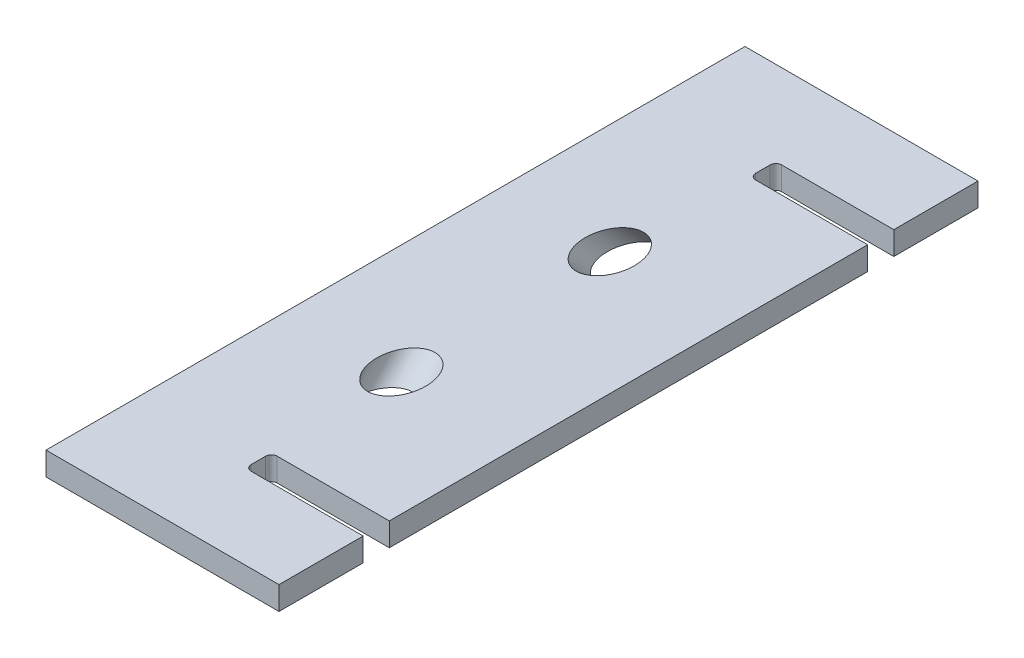
ISO-10303-21;
HEADER;
FILE_DESCRIPTION(('STEP AP214'),'2;1');
FILE_NAME('part.step','',(''),(''),'','','');
FILE_SCHEMA(('AUTOMOTIVE_DESIGN { 1 0 10303 214 1 1 1 1 }'));
ENDSEC;
DATA;
#1=APPLICATION_CONTEXT('core data for automotive mechanical design processes');
#2=APPLICATION_PROTOCOL_DEFINITION('international standard','automotive_design',2000,#1);
#3=PRODUCT_CONTEXT('',#1,'mechanical');
#4=PRODUCT('Part','Part','',(#3));
#5=PRODUCT_RELATED_PRODUCT_CATEGORY('part','',(#4));
#6=PRODUCT_DEFINITION_FORMATION('','',#4);
#7=PRODUCT_DEFINITION_CONTEXT('part definition',#1,'design');
#8=PRODUCT_DEFINITION('design','',#6,#7);
#9=PRODUCT_DEFINITION_SHAPE('','',#8);
#10=(LENGTH_UNIT() NAMED_UNIT(*) SI_UNIT(.MILLI.,.METRE.));
#11=(NAMED_UNIT(*) PLANE_ANGLE_UNIT() SI_UNIT($,.RADIAN.));
#12=(NAMED_UNIT(*) SI_UNIT($,.STERADIAN.) SOLID_ANGLE_UNIT());
#13=UNCERTAINTY_MEASURE_WITH_UNIT(LENGTH_MEASURE(1.E-05),#10,'distance_accuracy_value','');
#14=(GEOMETRIC_REPRESENTATION_CONTEXT(3) GLOBAL_UNCERTAINTY_ASSIGNED_CONTEXT((#13)) GLOBAL_UNIT_ASSIGNED_CONTEXT((#10,
#11,#12)) REPRESENTATION_CONTEXT('',''));
#15=CARTESIAN_POINT('',(0.,0.,0.));
#16=DIRECTION('',(0.,0.,1.));
#17=DIRECTION('',(1.,0.,0.));
#18=AXIS2_PLACEMENT_3D('',#15,#16,#17);
#19=CARTESIAN_POINT('',(2540.,217.4,-190.5));
#20=DIRECTION('',(-1.,0.,0.));
#21=DIRECTION('',(0.,0.,1.));
#22=AXIS2_PLACEMENT_3D('',#19,#20,#21);
#23=PLANE('',#22);
#24=DIRECTION('',(0.,0.,1.));
#25=VECTOR('',#24,1.);
#26=CARTESIAN_POINT('',(2540.,230.1,-190.5));
#27=LINE('',#26,#25);
#28=CARTESIAN_POINT('',(2540.,230.1,-190.5));
#29=VERTEX_POINT('',#28);
#30=CARTESIAN_POINT('',(2540.,230.1,190.5));
#31=VERTEX_POINT('',#30);
#32=EDGE_CURVE('E206',#29,#31,#27,.T.);
#33=ORIENTED_EDGE('',*,*,#32,.F.);
#34=DIRECTION('',(0.,1.,0.));
#35=VECTOR('',#34,1.);
#36=CARTESIAN_POINT('',(2540.,217.4,-190.5));
#37=LINE('',#36,#35);
#38=CARTESIAN_POINT('',(2540.,217.4,-190.5));
#39=VERTEX_POINT('',#38);
#40=EDGE_CURVE('E186',#39,#29,#37,.T.);
#41=ORIENTED_EDGE('',*,*,#40,.F.);
#42=DIRECTION('',(0.,0.,1.));
#43=VECTOR('',#42,1.);
#44=CARTESIAN_POINT('',(2540.,217.4,-190.5));
#45=LINE('',#44,#43);
#46=CARTESIAN_POINT('',(2540.,217.4,190.5));
#47=VERTEX_POINT('',#46);
#48=EDGE_CURVE('E171',#39,#47,#45,.T.);
#49=ORIENTED_EDGE('',*,*,#48,.T.);
#50=DIRECTION('',(0.,1.,0.));
#51=VECTOR('',#50,1.);
#52=CARTESIAN_POINT('',(2540.,217.4,190.5));
#53=LINE('',#52,#51);
#54=EDGE_CURVE('E159',#47,#31,#53,.T.);
#55=ORIENTED_EDGE('',*,*,#54,.T.);
#56=EDGE_LOOP('',(#33,#41,#49,#55));
#57=FACE_BOUND('',#56,.T.);
#58=ADVANCED_FACE('F47',(#57),#23,.T.);
#59=CARTESIAN_POINT('',(2540.,217.4,-190.5));
#60=DIRECTION('',(0.,0.,-1.));
#61=DIRECTION('',(-1.,0.,0.));
#62=AXIS2_PLACEMENT_3D('',#59,#60,#61);
#63=PLANE('',#62);
#64=DIRECTION('',(-1.,0.,0.));
#65=VECTOR('',#64,1.);
#66=CARTESIAN_POINT('',(2540.,230.1,-190.5));
#67=LINE('',#66,#65);
#68=CARTESIAN_POINT('',(2667.,230.1,-190.5));
#69=VERTEX_POINT('',#68);
#70=EDGE_CURVE('E227',#69,#29,#67,.T.);
#71=ORIENTED_EDGE('',*,*,#70,.F.);
#72=DIRECTION('',(0.,1.,0.));
#73=VECTOR('',#72,1.);
#74=CARTESIAN_POINT('',(2667.,217.4,-190.5));
#75=LINE('',#74,#73);
#76=CARTESIAN_POINT('',(2667.,217.4,-190.5));
#77=VERTEX_POINT('',#76);
#78=EDGE_CURVE('E203',#77,#69,#75,.T.);
#79=ORIENTED_EDGE('',*,*,#78,.F.);
#80=DIRECTION('',(-1.,0.,0.));
#81=VECTOR('',#80,1.);
#82=CARTESIAN_POINT('',(2540.,217.4,-190.5));
#83=LINE('',#82,#81);
#84=EDGE_CURVE('E170',#77,#39,#83,.T.);
#85=ORIENTED_EDGE('',*,*,#84,.T.);
#86=ORIENTED_EDGE('',*,*,#40,.T.);
#87=EDGE_LOOP('',(#71,#79,#85,#86));
#88=FACE_BOUND('',#87,.T.);
#89=ADVANCED_FACE('F398',(#88),#63,.T.);
#90=CARTESIAN_POINT('',(2667.,217.4,-190.5));
#91=DIRECTION('',(1.,0.,0.));
#92=DIRECTION('',(0.,0.,-1.));
#93=AXIS2_PLACEMENT_3D('',#90,#91,#92);
#94=PLANE('',#93);
#95=DIRECTION('',(0.,0.,-1.));
#96=VECTOR('',#95,1.);
#97=CARTESIAN_POINT('',(2667.,230.1,-190.5));
#98=LINE('',#97,#96);
#99=CARTESIAN_POINT('',(2667.,230.1,-144.604086105115));
#100=VERTEX_POINT('',#99);
#101=EDGE_CURVE('E223',#100,#69,#98,.T.);
#102=ORIENTED_EDGE('',*,*,#101,.F.);
#103=DIRECTION('',(0.,1.,0.));
#104=VECTOR('',#103,1.);
#105=CARTESIAN_POINT('',(2667.,217.4,-144.604086105115));
#106=LINE('',#105,#104);
#107=CARTESIAN_POINT('',(2667.,217.4,-144.604086105115));
#108=VERTEX_POINT('',#107);
#109=EDGE_CURVE('E264',#108,#100,#106,.T.);
#110=ORIENTED_EDGE('',*,*,#109,.F.);
#111=DIRECTION('',(0.,0.,-1.));
#112=VECTOR('',#111,1.);
#113=CARTESIAN_POINT('',(2667.,217.4,-190.5));
#114=LINE('',#113,#112);
#115=EDGE_CURVE('E199',#108,#77,#114,.T.);
#116=ORIENTED_EDGE('',*,*,#115,.T.);
#117=ORIENTED_EDGE('',*,*,#78,.T.);
#118=EDGE_LOOP('',(#102,#110,#116,#117));
#119=FACE_BOUND('',#118,.T.);
#120=ADVANCED_FACE('F395',(#119),#94,.T.);
#121=CARTESIAN_POINT('',(2603.5,217.4,-144.604086105115));
#122=DIRECTION('',(0.,0.,1.));
#123=DIRECTION('',(1.,0.,0.));
#124=AXIS2_PLACEMENT_3D('',#121,#122,#123);
#125=PLANE('',#124);
#126=DIRECTION('',(1.,0.,0.));
#127=VECTOR('',#126,1.);
#128=CARTESIAN_POINT('',(0.,230.1,-144.604086105115));
#129=LINE('',#128,#127);
#130=CARTESIAN_POINT('',(2605.913,230.1,-144.604086105115));
#131=VERTEX_POINT('',#130);
#132=EDGE_CURVE('E228',#131,#100,#129,.T.);
#133=ORIENTED_EDGE('',*,*,#132,.F.);
#134=DIRECTION('',(0.,1.,0.));
#135=VECTOR('',#134,1.);
#136=CARTESIAN_POINT('',(2605.913,217.4,-144.604086105115));
#137=LINE('',#136,#135);
#138=CARTESIAN_POINT('',(2605.913,217.4,-144.604086105115));
#139=VERTEX_POINT('',#138);
#140=EDGE_CURVE('E309',#131,#139,#137,.F.);
#141=ORIENTED_EDGE('',*,*,#140,.T.);
#142=DIRECTION('',(1.,0.,0.));
#143=VECTOR('',#142,1.);
#144=CARTESIAN_POINT('',(0.,217.4,-144.604086105115));
#145=LINE('',#144,#143);
#146=EDGE_CURVE('E237',#139,#108,#145,.T.);
#147=ORIENTED_EDGE('',*,*,#146,.T.);
#148=ORIENTED_EDGE('',*,*,#109,.T.);
#149=EDGE_LOOP('',(#133,#141,#147,#148));
#150=FACE_BOUND('',#149,.T.);
#151=ADVANCED_FACE('F391',(#150),#125,.T.);
#152=CARTESIAN_POINT('',(2602.738,217.4,-131.142086105115));
#153=DIRECTION('',(1.,0.,0.));
#154=DIRECTION('',(0.,0.,-1.));
#155=AXIS2_PLACEMENT_3D('',#152,#153,#154);
#156=PLANE('',#155);
#157=DIRECTION('',(0.,0.,-1.));
#158=VECTOR('',#157,1.);
#159=CARTESIAN_POINT('',(2602.738,217.4,9.10116426666717E-11));
#160=LINE('',#159,#158);
#161=CARTESIAN_POINT('',(2602.738,217.4,-133.555086105115));
#162=VERTEX_POINT('',#161);
#163=CARTESIAN_POINT('',(2602.738,217.4,-141.429086105115));
#164=VERTEX_POINT('',#163);
#165=EDGE_CURVE('E268',#162,#164,#160,.T.);
#166=ORIENTED_EDGE('',*,*,#165,.T.);
#167=DIRECTION('',(0.,1.,0.));
#168=VECTOR('',#167,1.);
#169=CARTESIAN_POINT('',(2602.738,230.1,-141.429086105115));
#170=LINE('',#169,#168);
#171=CARTESIAN_POINT('',(2602.738,230.1,-141.429086105115));
#172=VERTEX_POINT('',#171);
#173=EDGE_CURVE('E305',#164,#172,#170,.T.);
#174=ORIENTED_EDGE('',*,*,#173,.T.);
#175=DIRECTION('',(0.,0.,-1.));
#176=VECTOR('',#175,1.);
#177=CARTESIAN_POINT('',(2602.738,230.1,9.10116426666717E-11));
#178=LINE('',#177,#176);
#179=CARTESIAN_POINT('',(2602.738,230.1,-133.555086105115));
#180=VERTEX_POINT('',#179);
#181=EDGE_CURVE('E258',#180,#172,#178,.T.);
#182=ORIENTED_EDGE('',*,*,#181,.F.);
#183=DIRECTION('',(0.,1.,0.));
#184=VECTOR('',#183,1.);
#185=CARTESIAN_POINT('',(2602.738,217.4,-133.555086105115));
#186=LINE('',#185,#184);
#187=EDGE_CURVE('E248',#180,#162,#186,.F.);
#188=ORIENTED_EDGE('',*,*,#187,.T.);
#189=EDGE_LOOP('',(#166,#174,#182,#188));
#190=FACE_BOUND('',#189,.T.);
#191=ADVANCED_FACE('F381',(#190),#156,.T.);
#192=CARTESIAN_POINT('',(2667.,217.4,-130.380086105115));
#193=DIRECTION('',(0.,0.,-1.));
#194=DIRECTION('',(-1.,0.,0.));
#195=AXIS2_PLACEMENT_3D('',#192,#193,#194);
#196=PLANE('',#195);
#197=DIRECTION('',(-1.,0.,0.));
#198=VECTOR('',#197,1.);
#199=CARTESIAN_POINT('',(0.,217.4,-130.380086105115));
#200=LINE('',#199,#198);
#201=CARTESIAN_POINT('',(2667.,217.4,-130.380086105115));
#202=VERTEX_POINT('',#201);
#203=CARTESIAN_POINT('',(2605.913,217.4,-130.380086105115));
#204=VERTEX_POINT('',#203);
#205=EDGE_CURVE('E198',#202,#204,#200,.T.);
#206=ORIENTED_EDGE('',*,*,#205,.T.);
#207=DIRECTION('',(0.,1.,0.));
#208=VECTOR('',#207,1.);
#209=CARTESIAN_POINT('',(2605.913,230.1,-130.380086105115));
#210=LINE('',#209,#208);
#211=CARTESIAN_POINT('',(2605.913,230.1,-130.380086105115));
#212=VERTEX_POINT('',#211);
#213=EDGE_CURVE('E312',#204,#212,#210,.T.);
#214=ORIENTED_EDGE('',*,*,#213,.T.);
#215=DIRECTION('',(-1.,0.,0.));
#216=VECTOR('',#215,1.);
#217=CARTESIAN_POINT('',(0.,230.1,-130.380086105115));
#218=LINE('',#217,#216);
#219=CARTESIAN_POINT('',(2667.,230.1,-130.380086105115));
#220=VERTEX_POINT('',#219);
#221=EDGE_CURVE('E221',#220,#212,#218,.T.);
#222=ORIENTED_EDGE('',*,*,#221,.F.);
#223=DIRECTION('',(0.,1.,0.));
#224=VECTOR('',#223,1.);
#225=CARTESIAN_POINT('',(2667.,217.4,-130.380086105115));
#226=LINE('',#225,#224);
#227=EDGE_CURVE('E197',#202,#220,#226,.T.);
#228=ORIENTED_EDGE('',*,*,#227,.F.);
#229=EDGE_LOOP('',(#206,#214,#222,#228));
#230=FACE_BOUND('',#229,.T.);
#231=ADVANCED_FACE('F373',(#230),#196,.T.);
#232=CARTESIAN_POINT('',(2667.,217.4,-131.142086105115));
#233=DIRECTION('',(1.,0.,0.));
#234=DIRECTION('',(0.,0.,-1.));
#235=AXIS2_PLACEMENT_3D('',#232,#233,#234);
#236=PLANE('',#235);
#237=DIRECTION('',(0.,0.,-1.));
#238=VECTOR('',#237,1.);
#239=CARTESIAN_POINT('',(2667.,230.1,-131.142086105115));
#240=LINE('',#239,#238);
#241=CARTESIAN_POINT('',(2667.,230.1,130.380086105115));
#242=VERTEX_POINT('',#241);
#243=EDGE_CURVE('E217',#242,#220,#240,.T.);
#244=ORIENTED_EDGE('',*,*,#243,.F.);
#245=DIRECTION('',(0.,1.,0.));
#246=VECTOR('',#245,1.);
#247=CARTESIAN_POINT('',(2667.,217.4,130.380086105115));
#248=LINE('',#247,#246);
#249=CARTESIAN_POINT('',(2667.,217.4,130.380086105115));
#250=VERTEX_POINT('',#249);
#251=EDGE_CURVE('E283',#250,#242,#248,.T.);
#252=ORIENTED_EDGE('',*,*,#251,.F.);
#253=DIRECTION('',(0.,0.,-1.));
#254=VECTOR('',#253,1.);
#255=CARTESIAN_POINT('',(2667.,217.4,-131.142086105115));
#256=LINE('',#255,#254);
#257=EDGE_CURVE('E193',#250,#202,#256,.T.);
#258=ORIENTED_EDGE('',*,*,#257,.T.);
#259=ORIENTED_EDGE('',*,*,#227,.T.);
#260=EDGE_LOOP('',(#244,#252,#258,#259));
#261=FACE_BOUND('',#260,.T.);
#262=ADVANCED_FACE('F369',(#261),#236,.T.);
#263=CARTESIAN_POINT('',(2603.5,217.4,130.380086105115));
#264=DIRECTION('',(0.,0.,1.));
#265=DIRECTION('',(1.,0.,0.));
#266=AXIS2_PLACEMENT_3D('',#263,#264,#265);
#267=PLANE('',#266);
#268=DIRECTION('',(1.,0.,0.));
#269=VECTOR('',#268,1.);
#270=CARTESIAN_POINT('',(0.,230.1,130.380086105115));
#271=LINE('',#270,#269);
#272=CARTESIAN_POINT('',(2605.913,230.1,130.380086105115));
#273=VERTEX_POINT('',#272);
#274=EDGE_CURVE('E222',#273,#242,#271,.T.);
#275=ORIENTED_EDGE('',*,*,#274,.F.);
#276=DIRECTION('',(0.,1.,0.));
#277=VECTOR('',#276,1.);
#278=CARTESIAN_POINT('',(2605.913,217.4,130.380086105115));
#279=LINE('',#278,#277);
#280=CARTESIAN_POINT('',(2605.913,217.4,130.380086105115));
#281=VERTEX_POINT('',#280);
#282=EDGE_CURVE('E63',#273,#281,#279,.F.);
#283=ORIENTED_EDGE('',*,*,#282,.T.);
#284=DIRECTION('',(1.,0.,0.));
#285=VECTOR('',#284,1.);
#286=CARTESIAN_POINT('',(0.,217.4,130.380086105115));
#287=LINE('',#286,#285);
#288=EDGE_CURVE('E279',#281,#250,#287,.T.);
#289=ORIENTED_EDGE('',*,*,#288,.T.);
#290=ORIENTED_EDGE('',*,*,#251,.T.);
#291=EDGE_LOOP('',(#275,#283,#289,#290));
#292=FACE_BOUND('',#291,.T.);
#293=ADVANCED_FACE('F366',(#292),#267,.T.);
#294=CARTESIAN_POINT('',(2602.738,217.4,143.842086105115));
#295=DIRECTION('',(1.,0.,0.));
#296=DIRECTION('',(0.,0.,-1.));
#297=AXIS2_PLACEMENT_3D('',#294,#295,#296);
#298=PLANE('',#297);
#299=DIRECTION('',(0.,0.,-1.));
#300=VECTOR('',#299,1.);
#301=CARTESIAN_POINT('',(2602.738,230.1,0.));
#302=LINE('',#301,#300);
#303=CARTESIAN_POINT('',(2602.738,230.1,141.429086105115));
#304=VERTEX_POINT('',#303);
#305=CARTESIAN_POINT('',(2602.738,230.1,133.555086105115));
#306=VERTEX_POINT('',#305);
#307=EDGE_CURVE('E282',#304,#306,#302,.T.);
#308=ORIENTED_EDGE('',*,*,#307,.F.);
#309=DIRECTION('',(0.,1.,0.));
#310=VECTOR('',#309,1.);
#311=CARTESIAN_POINT('',(2602.738,217.4,141.429086105115));
#312=LINE('',#311,#310);
#313=CARTESIAN_POINT('',(2602.738,217.4,141.429086105115));
#314=VERTEX_POINT('',#313);
#315=EDGE_CURVE('E324',#304,#314,#312,.F.);
#316=ORIENTED_EDGE('',*,*,#315,.T.);
#317=DIRECTION('',(0.,0.,-1.));
#318=VECTOR('',#317,1.);
#319=CARTESIAN_POINT('',(2602.738,217.4,0.));
#320=LINE('',#319,#318);
#321=CARTESIAN_POINT('',(2602.738,217.4,133.555086105115));
#322=VERTEX_POINT('',#321);
#323=EDGE_CURVE('E287',#314,#322,#320,.T.);
#324=ORIENTED_EDGE('',*,*,#323,.T.);
#325=DIRECTION('',(0.,1.,0.));
#326=VECTOR('',#325,1.);
#327=CARTESIAN_POINT('',(2602.738,230.1,133.555086105115));
#328=LINE('',#327,#326);
#329=EDGE_CURVE('E320',#322,#306,#328,.T.);
#330=ORIENTED_EDGE('',*,*,#329,.T.);
#331=EDGE_LOOP('',(#308,#316,#324,#330));
#332=FACE_BOUND('',#331,.T.);
#333=ADVANCED_FACE('F359',(#332),#298,.T.);
#334=CARTESIAN_POINT('',(2667.,217.4,144.604086105115));
#335=DIRECTION('',(0.,0.,-1.));
#336=DIRECTION('',(-1.,0.,0.));
#337=AXIS2_PLACEMENT_3D('',#334,#335,#336);
#338=PLANE('',#337);
#339=DIRECTION('',(-1.,0.,0.));
#340=VECTOR('',#339,1.);
#341=CARTESIAN_POINT('',(0.,217.4,144.604086105115));
#342=LINE('',#341,#340);
#343=CARTESIAN_POINT('',(2667.,217.4,144.604086105115));
#344=VERTEX_POINT('',#343);
#345=CARTESIAN_POINT('',(2605.913,217.4,144.604086105115));
#346=VERTEX_POINT('',#345);
#347=EDGE_CURVE('E192',#344,#346,#342,.T.);
#348=ORIENTED_EDGE('',*,*,#347,.T.);
#349=DIRECTION('',(0.,1.,0.));
#350=VECTOR('',#349,1.);
#351=CARTESIAN_POINT('',(2605.913,230.1,144.604086105115));
#352=LINE('',#351,#350);
#353=CARTESIAN_POINT('',(2605.913,230.1,144.604086105115));
#354=VERTEX_POINT('',#353);
#355=EDGE_CURVE('E316',#346,#354,#352,.T.);
#356=ORIENTED_EDGE('',*,*,#355,.T.);
#357=DIRECTION('',(-1.,0.,0.));
#358=VECTOR('',#357,1.);
#359=CARTESIAN_POINT('',(0.,230.1,144.604086105115));
#360=LINE('',#359,#358);
#361=CARTESIAN_POINT('',(2667.,230.1,144.604086105115));
#362=VERTEX_POINT('',#361);
#363=EDGE_CURVE('E216',#362,#354,#360,.T.);
#364=ORIENTED_EDGE('',*,*,#363,.F.);
#365=DIRECTION('',(0.,1.,0.));
#366=VECTOR('',#365,1.);
#367=CARTESIAN_POINT('',(2667.,217.4,144.604086105115));
#368=LINE('',#367,#366);
#369=EDGE_CURVE('E184',#344,#362,#368,.T.);
#370=ORIENTED_EDGE('',*,*,#369,.F.);
#371=EDGE_LOOP('',(#348,#356,#364,#370));
#372=FACE_BOUND('',#371,.T.);
#373=ADVANCED_FACE('F353',(#372),#338,.T.);
#374=CARTESIAN_POINT('',(2667.,217.4,143.842086105115));
#375=DIRECTION('',(1.,0.,0.));
#376=DIRECTION('',(0.,0.,-1.));
#377=AXIS2_PLACEMENT_3D('',#374,#375,#376);
#378=PLANE('',#377);
#379=DIRECTION('',(0.,0.,-1.));
#380=VECTOR('',#379,1.);
#381=CARTESIAN_POINT('',(2667.,230.1,143.842086105115));
#382=LINE('',#381,#380);
#383=CARTESIAN_POINT('',(2667.,230.1,190.5));
#384=VERTEX_POINT('',#383);
#385=EDGE_CURVE('E212',#384,#362,#382,.T.);
#386=ORIENTED_EDGE('',*,*,#385,.F.);
#387=DIRECTION('',(0.,1.,0.));
#388=VECTOR('',#387,1.);
#389=CARTESIAN_POINT('',(2667.,217.4,190.5));
#390=LINE('',#389,#388);
#391=CARTESIAN_POINT('',(2667.,217.4,190.5));
#392=VERTEX_POINT('',#391);
#393=EDGE_CURVE('E183',#392,#384,#390,.T.);
#394=ORIENTED_EDGE('',*,*,#393,.F.);
#395=DIRECTION('',(0.,0.,-1.));
#396=VECTOR('',#395,1.);
#397=CARTESIAN_POINT('',(2667.,217.4,143.842086105115));
#398=LINE('',#397,#396);
#399=EDGE_CURVE('E181',#392,#344,#398,.T.);
#400=ORIENTED_EDGE('',*,*,#399,.T.);
#401=ORIENTED_EDGE('',*,*,#369,.T.);
#402=EDGE_LOOP('',(#386,#394,#400,#401));
#403=FACE_BOUND('',#402,.T.);
#404=ADVANCED_FACE('F401',(#403),#378,.T.);
#405=CARTESIAN_POINT('',(2540.,217.4,190.5));
#406=DIRECTION('',(0.,0.,1.));
#407=DIRECTION('',(1.,0.,0.));
#408=AXIS2_PLACEMENT_3D('',#405,#406,#407);
#409=PLANE('',#408);
#410=DIRECTION('',(1.,0.,0.));
#411=VECTOR('',#410,1.);
#412=CARTESIAN_POINT('',(2540.,230.1,190.5));
#413=LINE('',#412,#411);
#414=EDGE_CURVE('E164',#31,#384,#413,.T.);
#415=ORIENTED_EDGE('',*,*,#414,.F.);
#416=ORIENTED_EDGE('',*,*,#54,.F.);
#417=DIRECTION('',(1.,0.,0.));
#418=VECTOR('',#417,1.);
#419=CARTESIAN_POINT('',(2540.,217.4,190.5));
#420=LINE('',#419,#418);
#421=EDGE_CURVE('E162',#47,#392,#420,.T.);
#422=ORIENTED_EDGE('',*,*,#421,.T.);
#423=ORIENTED_EDGE('',*,*,#393,.T.);
#424=EDGE_LOOP('',(#415,#416,#422,#423));
#425=FACE_BOUND('',#424,.T.);
#426=ADVANCED_FACE('F161',(#425),#409,.T.);
#427=CARTESIAN_POINT('',(0.,217.4,0.));
#428=DIRECTION('',(0.,1.,0.));
#429=DIRECTION('',(0.,0.,1.));
#430=AXIS2_PLACEMENT_3D('',#427,#428,#429);
#431=PLANE('',#430);
#432=CARTESIAN_POINT('',(2599.99999999996,217.4,-68.8448275862046));
#433=DIRECTION('',(0.,1.,0.));
#434=DIRECTION('',(0.,0.,1.));
#435=AXIS2_PLACEMENT_3D('',#432,#433,#434);
#436=ELLIPSE('',#435,18.37729007727,13.3349999999999);
#437=CARTESIAN_POINT('',(2599.99999999996,217.4,-50.4675375089346));
#438=VERTEX_POINT('',#437);
#439=EDGE_CURVE('E244',#438,#438,#436,.F.);
#440=ORIENTED_EDGE('',*,*,#439,.F.);
#441=EDGE_LOOP('',(#440));
#442=FACE_BOUND('',#441,.T.);
#443=CARTESIAN_POINT('',(2599.99999999996,217.4,68.8448275862026));
#444=DIRECTION('',(0.,1.,0.));
#445=DIRECTION('',(0.,0.,1.));
#446=AXIS2_PLACEMENT_3D('',#443,#444,#445);
#447=ELLIPSE('',#446,18.3772900772699,13.3349999999999);
#448=CARTESIAN_POINT('',(2599.99999999996,217.4,87.2221176634725));
#449=VERTEX_POINT('',#448);
#450=EDGE_CURVE('E232',#449,#449,#447,.F.);
#451=ORIENTED_EDGE('',*,*,#450,.F.);
#452=EDGE_LOOP('',(#451));
#453=FACE_BOUND('',#452,.T.);
#454=ORIENTED_EDGE('',*,*,#48,.F.);
#455=ORIENTED_EDGE('',*,*,#84,.F.);
#456=ORIENTED_EDGE('',*,*,#115,.F.);
#457=ORIENTED_EDGE('',*,*,#146,.F.);
#458=CARTESIAN_POINT('',(2605.913,217.4,-141.429086105115));
#459=DIRECTION('',(0.,1.,0.));
#460=DIRECTION('',(0.,0.,1.));
#461=AXIS2_PLACEMENT_3D('',#458,#459,#460);
#462=CIRCLE('',#461,3.175);
#463=EDGE_CURVE('E332',#139,#164,#462,.T.);
#464=ORIENTED_EDGE('',*,*,#463,.T.);
#465=ORIENTED_EDGE('',*,*,#165,.F.);
#466=CARTESIAN_POINT('',(2605.913,217.4,-133.555086105115));
#467=DIRECTION('',(0.,1.,0.));
#468=DIRECTION('',(0.,0.,1.));
#469=AXIS2_PLACEMENT_3D('',#466,#467,#468);
#470=CIRCLE('',#469,3.175);
#471=EDGE_CURVE('E338',#162,#204,#470,.T.);
#472=ORIENTED_EDGE('',*,*,#471,.T.);
#473=ORIENTED_EDGE('',*,*,#205,.F.);
#474=ORIENTED_EDGE('',*,*,#257,.F.);
#475=ORIENTED_EDGE('',*,*,#288,.F.);
#476=CARTESIAN_POINT('',(2605.913,217.4,133.555086105115));
#477=DIRECTION('',(0.,1.,0.));
#478=DIRECTION('',(0.,0.,1.));
#479=AXIS2_PLACEMENT_3D('',#476,#477,#478);
#480=CIRCLE('',#479,3.175);
#481=EDGE_CURVE('E12',#281,#322,#480,.T.);
#482=ORIENTED_EDGE('',*,*,#481,.T.);
#483=ORIENTED_EDGE('',*,*,#323,.F.);
#484=CARTESIAN_POINT('',(2605.913,217.4,141.429086105115));
#485=DIRECTION('',(0.,1.,0.));
#486=DIRECTION('',(0.,0.,1.));
#487=AXIS2_PLACEMENT_3D('',#484,#485,#486);
#488=CIRCLE('',#487,3.175);
#489=EDGE_CURVE('E344',#314,#346,#488,.T.);
#490=ORIENTED_EDGE('',*,*,#489,.T.);
#491=ORIENTED_EDGE('',*,*,#347,.F.);
#492=ORIENTED_EDGE('',*,*,#399,.F.);
#493=ORIENTED_EDGE('',*,*,#421,.F.);
#494=EDGE_LOOP('',(#454,#455,#456,#457,#464,#465,#472,#473,#474,#475,#482,#483,#490,#491,#492,#493));
#495=FACE_BOUND('',#494,.T.);
#496=ADVANCED_FACE('F176',(#442,#453,#495),#431,.F.);
#497=CARTESIAN_POINT('',(0.,230.1,0.));
#498=DIRECTION('',(0.,1.,0.));
#499=DIRECTION('',(0.,0.,1.));
#500=AXIS2_PLACEMENT_3D('',#497,#498,#499);
#501=PLANE('',#500);
#502=CARTESIAN_POINT('',(2599.99999999996,230.1,-56.8017241379285));
#503=DIRECTION('',(0.,1.,0.));
#504=DIRECTION('',(0.,0.,1.));
#505=AXIS2_PLACEMENT_3D('',#502,#503,#504);
#506=ELLIPSE('',#505,18.37729007727,13.3349999999999);
#507=CARTESIAN_POINT('',(2599.99999999996,230.1,-38.4244340606586));
#508=VERTEX_POINT('',#507);
#509=EDGE_CURVE('E239',#508,#508,#506,.F.);
#510=ORIENTED_EDGE('',*,*,#509,.T.);
#511=EDGE_LOOP('',(#510));
#512=FACE_BOUND('',#511,.T.);
#513=CARTESIAN_POINT('',(2599.99999999996,230.1,56.8017241379268));
#514=DIRECTION('',(0.,1.,0.));
#515=DIRECTION('',(0.,0.,1.));
#516=AXIS2_PLACEMENT_3D('',#513,#514,#515);
#517=ELLIPSE('',#516,18.3772900772699,13.3349999999999);
#518=CARTESIAN_POINT('',(2599.99999999996,230.1,75.1790142151966));
#519=VERTEX_POINT('',#518);
#520=EDGE_CURVE('E209',#519,#519,#517,.F.);
#521=ORIENTED_EDGE('',*,*,#520,.T.);
#522=EDGE_LOOP('',(#521));
#523=FACE_BOUND('',#522,.T.);
#524=ORIENTED_EDGE('',*,*,#32,.T.);
#525=ORIENTED_EDGE('',*,*,#414,.T.);
#526=ORIENTED_EDGE('',*,*,#385,.T.);
#527=ORIENTED_EDGE('',*,*,#363,.T.);
#528=CARTESIAN_POINT('',(2605.913,230.1,141.429086105115));
#529=DIRECTION('',(0.,1.,0.));
#530=DIRECTION('',(0.,0.,1.));
#531=AXIS2_PLACEMENT_3D('',#528,#529,#530);
#532=CIRCLE('',#531,3.175);
#533=EDGE_CURVE('E341',#354,#304,#532,.F.);
#534=ORIENTED_EDGE('',*,*,#533,.T.);
#535=ORIENTED_EDGE('',*,*,#307,.T.);
#536=CARTESIAN_POINT('',(2605.913,230.1,133.555086105115));
#537=DIRECTION('',(0.,1.,0.));
#538=DIRECTION('',(0.,0.,1.));
#539=AXIS2_PLACEMENT_3D('',#536,#537,#538);
#540=CIRCLE('',#539,3.175);
#541=EDGE_CURVE('E56',#306,#273,#540,.F.);
#542=ORIENTED_EDGE('',*,*,#541,.T.);
#543=ORIENTED_EDGE('',*,*,#274,.T.);
#544=ORIENTED_EDGE('',*,*,#243,.T.);
#545=ORIENTED_EDGE('',*,*,#221,.T.);
#546=CARTESIAN_POINT('',(2605.913,230.1,-133.555086105115));
#547=DIRECTION('',(0.,1.,0.));
#548=DIRECTION('',(0.,0.,1.));
#549=AXIS2_PLACEMENT_3D('',#546,#547,#548);
#550=CIRCLE('',#549,3.175);
#551=EDGE_CURVE('E335',#212,#180,#550,.F.);
#552=ORIENTED_EDGE('',*,*,#551,.T.);
#553=ORIENTED_EDGE('',*,*,#181,.T.);
#554=CARTESIAN_POINT('',(2605.913,230.1,-141.429086105115));
#555=DIRECTION('',(0.,1.,0.));
#556=DIRECTION('',(0.,0.,1.));
#557=AXIS2_PLACEMENT_3D('',#554,#555,#556);
#558=CIRCLE('',#557,3.175);
#559=EDGE_CURVE('E329',#172,#131,#558,.F.);
#560=ORIENTED_EDGE('',*,*,#559,.T.);
#561=ORIENTED_EDGE('',*,*,#132,.T.);
#562=ORIENTED_EDGE('',*,*,#101,.T.);
#563=ORIENTED_EDGE('',*,*,#70,.T.);
#564=EDGE_LOOP('',(#524,#525,#526,#527,#534,#535,#542,#543,#544,#545,#552,#553,#560,#561,#562,#563));
#565=FACE_BOUND('',#564,.T.);
#566=ADVANCED_FACE('F357',(#512,#523,#565),#501,.T.);
#567=CARTESIAN_POINT('',(2599.99999999996,289.999999999996,-4.44089209850063E-13));
#568=DIRECTION('',(0.,-0.725623851173434,0.688091583009292));
#569=DIRECTION('',(0.,-0.688091583009292,-0.725623851173434));
#570=AXIS2_PLACEMENT_3D('',#567,#568,#569);
#571=CYLINDRICAL_SURFACE('',#570,13.3349999999999);
#572=ORIENTED_EDGE('',*,*,#520,.F.);
#573=EDGE_LOOP('',(#572));
#574=FACE_BOUND('',#573,.T.);
#575=ORIENTED_EDGE('',*,*,#450,.T.);
#576=EDGE_LOOP('',(#575));
#577=FACE_BOUND('',#576,.T.);
#578=ADVANCED_FACE('F420',(#574,#577),#571,.F.);
#579=CARTESIAN_POINT('',(2599.99999999996,0.,-275.000000000001));
#580=DIRECTION('',(0.,0.725623851173429,0.688091583009297));
#581=DIRECTION('',(0.,-0.688091583009297,0.725623851173429));
#582=AXIS2_PLACEMENT_3D('',#579,#580,#581);
#583=CYLINDRICAL_SURFACE('',#582,13.3349999999999);
#584=ORIENTED_EDGE('',*,*,#509,.F.);
#585=EDGE_LOOP('',(#584));
#586=FACE_BOUND('',#585,.T.);
#587=ORIENTED_EDGE('',*,*,#439,.T.);
#588=EDGE_LOOP('',(#587));
#589=FACE_BOUND('',#588,.T.);
#590=ADVANCED_FACE('F425',(#586,#589),#583,.F.);
#591=CARTESIAN_POINT('',(2605.913,217.4,-141.429086105115));
#592=DIRECTION('',(0.,-1.,0.));
#593=DIRECTION('',(0.,0.,-1.));
#594=AXIS2_PLACEMENT_3D('',#591,#592,#593);
#595=CYLINDRICAL_SURFACE('',#594,3.175);
#596=ORIENTED_EDGE('',*,*,#463,.F.);
#597=ORIENTED_EDGE('',*,*,#140,.F.);
#598=ORIENTED_EDGE('',*,*,#559,.F.);
#599=ORIENTED_EDGE('',*,*,#173,.F.);
#600=EDGE_LOOP('',(#596,#597,#598,#599));
#601=FACE_BOUND('',#600,.T.);
#602=ADVANCED_FACE('F388',(#601),#595,.F.);
#603=CARTESIAN_POINT('',(2605.913,217.4,-133.555086105115));
#604=DIRECTION('',(0.,-1.,0.));
#605=DIRECTION('',(0.,0.,-1.));
#606=AXIS2_PLACEMENT_3D('',#603,#604,#605);
#607=CYLINDRICAL_SURFACE('',#606,3.175);
#608=ORIENTED_EDGE('',*,*,#471,.F.);
#609=ORIENTED_EDGE('',*,*,#187,.F.);
#610=ORIENTED_EDGE('',*,*,#551,.F.);
#611=ORIENTED_EDGE('',*,*,#213,.F.);
#612=EDGE_LOOP('',(#608,#609,#610,#611));
#613=FACE_BOUND('',#612,.T.);
#614=ADVANCED_FACE('F377',(#613),#607,.F.);
#615=CARTESIAN_POINT('',(2605.913,217.4,141.429086105115));
#616=DIRECTION('',(0.,-1.,0.));
#617=DIRECTION('',(0.,0.,-1.));
#618=AXIS2_PLACEMENT_3D('',#615,#616,#617);
#619=CYLINDRICAL_SURFACE('',#618,3.175);
#620=ORIENTED_EDGE('',*,*,#489,.F.);
#621=ORIENTED_EDGE('',*,*,#315,.F.);
#622=ORIENTED_EDGE('',*,*,#533,.F.);
#623=ORIENTED_EDGE('',*,*,#355,.F.);
#624=EDGE_LOOP('',(#620,#621,#622,#623));
#625=FACE_BOUND('',#624,.T.);
#626=ADVANCED_FACE('F355',(#625),#619,.F.);
#627=CARTESIAN_POINT('',(2605.913,217.4,133.555086105115));
#628=DIRECTION('',(0.,-1.,0.));
#629=DIRECTION('',(0.,0.,-1.));
#630=AXIS2_PLACEMENT_3D('',#627,#628,#629);
#631=CYLINDRICAL_SURFACE('',#630,3.175);
#632=ORIENTED_EDGE('',*,*,#481,.F.);
#633=ORIENTED_EDGE('',*,*,#282,.F.);
#634=ORIENTED_EDGE('',*,*,#541,.F.);
#635=ORIENTED_EDGE('',*,*,#329,.F.);
#636=EDGE_LOOP('',(#632,#633,#634,#635));
#637=FACE_BOUND('',#636,.T.);
#638=ADVANCED_FACE('F49',(#637),#631,.F.);
#639=CLOSED_SHELL('',(#58,#89,#120,#151,#191,#231,#262,#293,#333,#373,#404,#426,#496,#566,#578,
#590,#602,#614,#626,#638));
#640=MANIFOLD_SOLID_BREP('B2',#639);
#641=ADVANCED_BREP_SHAPE_REPRESENTATION('',(#18,#640),#14);
#642=SHAPE_DEFINITION_REPRESENTATION(#9,#641);
ENDSEC;
END-ISO-10303-21;
